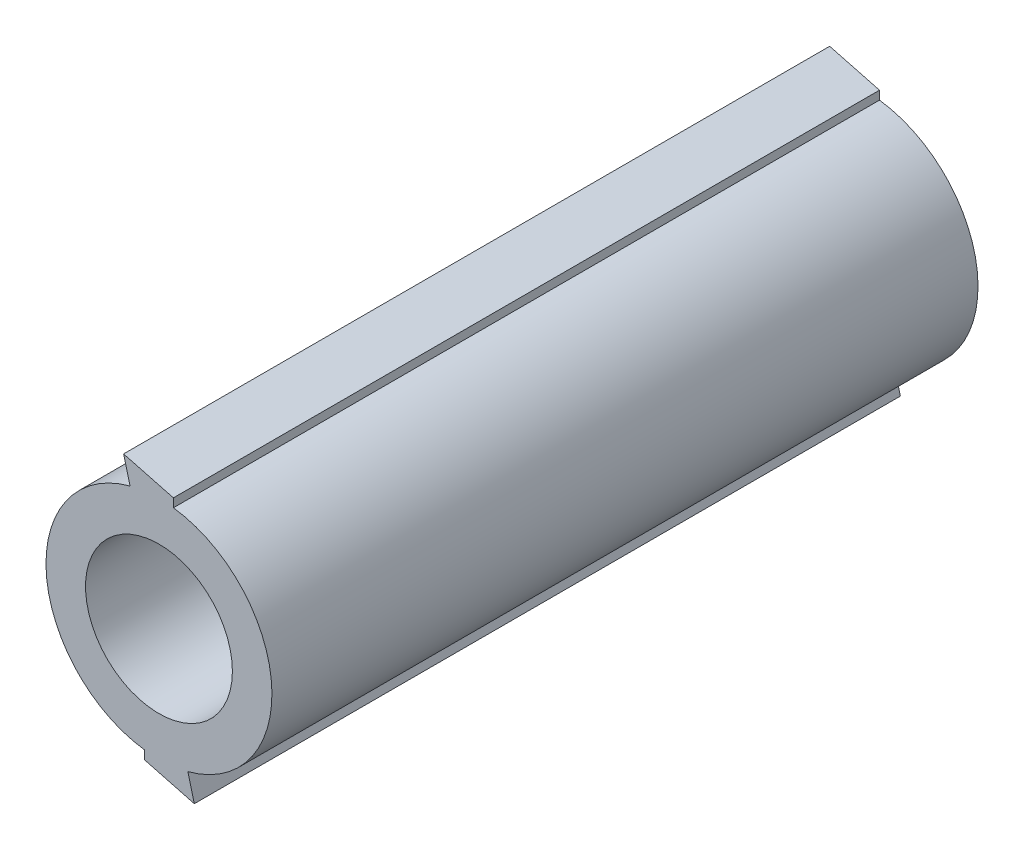
ISO-10303-21;
HEADER;
FILE_DESCRIPTION(('STEP AP214'),'2;1');
FILE_NAME('part.step','',(''),(''),'','','');
FILE_SCHEMA(('AUTOMOTIVE_DESIGN { 1 0 10303 214 1 1 1 1 }'));
ENDSEC;
DATA;
#1=APPLICATION_CONTEXT('core data for automotive mechanical design processes');
#2=APPLICATION_PROTOCOL_DEFINITION('international standard','automotive_design',2000,#1);
#3=PRODUCT_CONTEXT('',#1,'mechanical');
#4=PRODUCT('Part','Part','',(#3));
#5=PRODUCT_RELATED_PRODUCT_CATEGORY('part','',(#4));
#6=PRODUCT_DEFINITION_FORMATION('','',#4);
#7=PRODUCT_DEFINITION_CONTEXT('part definition',#1,'design');
#8=PRODUCT_DEFINITION('design','',#6,#7);
#9=PRODUCT_DEFINITION_SHAPE('','',#8);
#10=(LENGTH_UNIT() NAMED_UNIT(*) SI_UNIT(.MILLI.,.METRE.));
#11=(NAMED_UNIT(*) PLANE_ANGLE_UNIT() SI_UNIT($,.RADIAN.));
#12=(NAMED_UNIT(*) SI_UNIT($,.STERADIAN.) SOLID_ANGLE_UNIT());
#13=UNCERTAINTY_MEASURE_WITH_UNIT(LENGTH_MEASURE(1.E-05),#10,'distance_accuracy_value','');
#14=(GEOMETRIC_REPRESENTATION_CONTEXT(3) GLOBAL_UNCERTAINTY_ASSIGNED_CONTEXT((#13)) GLOBAL_UNIT_ASSIGNED_CONTEXT((#10,
#11,#12)) REPRESENTATION_CONTEXT('',''));
#15=CARTESIAN_POINT('',(0.,0.,0.));
#16=DIRECTION('',(0.,0.,1.));
#17=DIRECTION('',(1.,0.,0.));
#18=AXIS2_PLACEMENT_3D('',#15,#16,#17);
#19=CARTESIAN_POINT('',(0.,0.,200.));
#20=DIRECTION('',(0.,0.,-1.));
#21=DIRECTION('',(-1.,0.,0.));
#22=AXIS2_PLACEMENT_3D('',#19,#20,#21);
#23=CYLINDRICAL_SURFACE('',#22,32.);
#24=DIRECTION('',(0.,0.,1.));
#25=VECTOR('',#24,1.);
#26=CARTESIAN_POINT('',(-4.09392435380043,-31.7370411882608,0.));
#27=LINE('',#26,#25);
#28=CARTESIAN_POINT('',(-4.09392435380043,-31.7370411882608,0.));
#29=VERTEX_POINT('',#28);
#30=CARTESIAN_POINT('',(-4.09392435380043,-31.7370411882608,200.));
#31=VERTEX_POINT('',#30);
#32=EDGE_CURVE('E147',#29,#31,#27,.T.);
#33=ORIENTED_EDGE('',*,*,#32,.T.);
#34=CARTESIAN_POINT('',(0.,0.,200.));
#35=DIRECTION('',(0.,0.,1.));
#36=DIRECTION('',(1.,0.,0.));
#37=AXIS2_PLACEMENT_3D('',#34,#35,#36);
#38=CIRCLE('',#37,32.);
#39=CARTESIAN_POINT('',(-8.1791238977649,30.9370640537368,200.));
#40=VERTEX_POINT('',#39);
#41=EDGE_CURVE('E11',#40,#31,#38,.T.);
#42=ORIENTED_EDGE('',*,*,#41,.F.);
#43=DIRECTION('',(0.,0.,1.));
#44=VECTOR('',#43,1.);
#45=CARTESIAN_POINT('',(-8.1791238977649,30.9370640537368,0.));
#46=LINE('',#45,#44);
#47=CARTESIAN_POINT('',(-8.1791238977649,30.9370640537368,0.));
#48=VERTEX_POINT('',#47);
#49=EDGE_CURVE('E133',#48,#40,#46,.T.);
#50=ORIENTED_EDGE('',*,*,#49,.F.);
#51=CARTESIAN_POINT('',(0.,0.,0.));
#52=DIRECTION('',(0.,0.,1.));
#53=DIRECTION('',(1.,0.,0.));
#54=AXIS2_PLACEMENT_3D('',#51,#52,#53);
#55=CIRCLE('',#54,32.);
#56=EDGE_CURVE('E157',#48,#29,#55,.T.);
#57=ORIENTED_EDGE('',*,*,#56,.T.);
#58=EDGE_LOOP('',(#33,#42,#50,#57));
#59=FACE_BOUND('',#58,.T.);
#60=ADVANCED_FACE('F41',(#59),#23,.T.);
#61=DIRECTION('',(0.,0.,1.));
#62=VECTOR('',#61,1.);
#63=CARTESIAN_POINT('',(8.17912389776288,-30.9370640537373,0.));
#64=LINE('',#63,#62);
#65=CARTESIAN_POINT('',(8.17912389776288,-30.9370640537373,0.));
#66=VERTEX_POINT('',#65);
#67=CARTESIAN_POINT('',(8.17912389776288,-30.9370640537373,200.));
#68=VERTEX_POINT('',#67);
#69=EDGE_CURVE('E153',#66,#68,#64,.T.);
#70=ORIENTED_EDGE('',*,*,#69,.F.);
#71=CARTESIAN_POINT('',(0.,0.,0.));
#72=DIRECTION('',(0.,0.,1.));
#73=DIRECTION('',(1.,0.,0.));
#74=AXIS2_PLACEMENT_3D('',#71,#72,#73);
#75=CIRCLE('',#74,32.);
#76=CARTESIAN_POINT('',(4.09392435379836,31.737041188261,0.));
#77=VERTEX_POINT('',#76);
#78=EDGE_CURVE('E127',#66,#77,#75,.T.);
#79=ORIENTED_EDGE('',*,*,#78,.T.);
#80=DIRECTION('',(0.,0.,1.));
#81=VECTOR('',#80,1.);
#82=CARTESIAN_POINT('',(4.09392435379836,31.737041188261,0.));
#83=LINE('',#82,#81);
#84=CARTESIAN_POINT('',(4.09392435379836,31.737041188261,200.));
#85=VERTEX_POINT('',#84);
#86=EDGE_CURVE('E125',#77,#85,#83,.T.);
#87=ORIENTED_EDGE('',*,*,#86,.T.);
#88=CARTESIAN_POINT('',(0.,0.,200.));
#89=DIRECTION('',(0.,0.,1.));
#90=DIRECTION('',(1.,0.,0.));
#91=AXIS2_PLACEMENT_3D('',#88,#89,#90);
#92=CIRCLE('',#91,32.);
#93=EDGE_CURVE('E52',#68,#85,#92,.T.);
#94=ORIENTED_EDGE('',*,*,#93,.F.);
#95=EDGE_LOOP('',(#70,#79,#87,#94));
#96=FACE_BOUND('',#95,.T.);
#97=ADVANCED_FACE('F126',(#96),#23,.T.);
#98=CARTESIAN_POINT('',(0.,0.,200.));
#99=DIRECTION('',(0.,0.,-1.));
#100=DIRECTION('',(-1.,0.,0.));
#101=AXIS2_PLACEMENT_3D('',#98,#99,#100);
#102=CYLINDRICAL_SURFACE('',#101,20.8);
#103=CARTESIAN_POINT('',(0.,0.,200.));
#104=DIRECTION('',(0.,0.,1.));
#105=DIRECTION('',(1.,0.,0.));
#106=AXIS2_PLACEMENT_3D('',#103,#104,#105);
#107=CIRCLE('',#106,20.8);
#108=CARTESIAN_POINT('',(20.8,0.,200.));
#109=VERTEX_POINT('',#108);
#110=EDGE_CURVE('E122',#109,#109,#107,.T.);
#111=ORIENTED_EDGE('',*,*,#110,.T.);
#112=EDGE_LOOP('',(#111));
#113=FACE_BOUND('',#112,.T.);
#114=CARTESIAN_POINT('',(0.,0.,0.));
#115=DIRECTION('',(0.,0.,1.));
#116=DIRECTION('',(1.,0.,0.));
#117=AXIS2_PLACEMENT_3D('',#114,#115,#116);
#118=CIRCLE('',#117,20.8);
#119=CARTESIAN_POINT('',(20.8,0.,0.));
#120=VERTEX_POINT('',#119);
#121=EDGE_CURVE('E158',#120,#120,#118,.T.);
#122=ORIENTED_EDGE('',*,*,#121,.F.);
#123=EDGE_LOOP('',(#122));
#124=FACE_BOUND('',#123,.T.);
#125=ADVANCED_FACE('F277',(#113,#124),#102,.F.);
#126=CARTESIAN_POINT('',(0.,0.,200.));
#127=DIRECTION('',(0.,0.,1.));
#128=DIRECTION('',(1.,0.,0.));
#129=AXIS2_PLACEMENT_3D('',#126,#127,#128);
#130=PLANE('',#129);
#131=ORIENTED_EDGE('',*,*,#110,.F.);
#132=EDGE_LOOP('',(#131));
#133=FACE_BOUND('',#132,.T.);
#134=ORIENTED_EDGE('',*,*,#41,.T.);
#135=DIRECTION('',(0.,1.,0.));
#136=VECTOR('',#135,1.);
#137=CARTESIAN_POINT('',(-4.09392435379839,2.72570661015883E-13,200.));
#138=LINE('',#137,#136);
#139=CARTESIAN_POINT('',(-4.09392435380058,-34.1818057680252,200.));
#140=VERTEX_POINT('',#139);
#141=EDGE_CURVE('E101',#140,#31,#138,.T.);
#142=ORIENTED_EDGE('',*,*,#141,.F.);
#143=DIRECTION('',(-0.967039824193414,0.254625172408328,0.));
#144=VECTOR('',#143,1.);
#145=CARTESIAN_POINT('',(-8.68210311175342,-32.9737212837504,200.));
#146=LINE('',#145,#144);
#147=CARTESIAN_POINT('',(10.0194267747595,-37.8979034658282,200.));
#148=VERTEX_POINT('',#147);
#149=EDGE_CURVE('E249',#148,#140,#146,.T.);
#150=ORIENTED_EDGE('',*,*,#149,.F.);
#151=DIRECTION('',(0.255597621805091,-0.96678325167929,0.));
#152=VECTOR('',#151,1.);
#153=CARTESIAN_POINT('',(0.,0.,200.));
#154=LINE('',#153,#152);
#155=EDGE_CURVE('E120',#68,#148,#154,.T.);
#156=ORIENTED_EDGE('',*,*,#155,.F.);
#157=ORIENTED_EDGE('',*,*,#93,.T.);
#158=DIRECTION('',(0.,-1.,0.));
#159=VECTOR('',#158,1.);
#160=CARTESIAN_POINT('',(4.09392435379836,0.,200.));
#161=LINE('',#160,#159);
#162=CARTESIAN_POINT('',(4.09392435379836,34.1818057680255,200.));
#163=VERTEX_POINT('',#162);
#164=EDGE_CURVE('E119',#163,#85,#161,.T.);
#165=ORIENTED_EDGE('',*,*,#164,.F.);
#166=DIRECTION('',(0.96703982419343,-0.254625172408267,0.));
#167=VECTOR('',#166,1.);
#168=CARTESIAN_POINT('',(8.68210311175129,32.9737212837509,200.));
#169=LINE('',#168,#167);
#170=CARTESIAN_POINT('',(-10.019426774762,37.8979034658276,200.));
#171=VERTEX_POINT('',#170);
#172=EDGE_CURVE('E140',#171,#163,#169,.T.);
#173=ORIENTED_EDGE('',*,*,#172,.F.);
#174=DIRECTION('',(-0.255597621805152,0.966783251679274,0.));
#175=VECTOR('',#174,1.);
#176=CARTESIAN_POINT('',(0.,0.,200.));
#177=LINE('',#176,#175);
#178=EDGE_CURVE('E145',#40,#171,#177,.T.);
#179=ORIENTED_EDGE('',*,*,#178,.F.);
#180=EDGE_LOOP('',(#134,#142,#150,#156,#157,#165,#173,#179));
#181=FACE_BOUND('',#180,.T.);
#182=ADVANCED_FACE('F116',(#133,#181),#130,.T.);
#183=CARTESIAN_POINT('',(0.,0.,0.));
#184=DIRECTION('',(0.,0.,1.));
#185=DIRECTION('',(1.,0.,0.));
#186=AXIS2_PLACEMENT_3D('',#183,#184,#185);
#187=PLANE('',#186);
#188=CARTESIAN_POINT('',(0.,26.4,0.));
#189=DIRECTION('',(0.,0.,-1.));
#190=DIRECTION('',(-1.,0.,0.));
#191=AXIS2_PLACEMENT_3D('',#188,#189,#190);
#192=CIRCLE('',#191,3.2);
#193=CARTESIAN_POINT('',(-3.20000000000002,26.4,0.));
#194=VERTEX_POINT('',#193);
#195=EDGE_CURVE('E160',#194,#194,#192,.T.);
#196=ORIENTED_EDGE('',*,*,#195,.F.);
#197=EDGE_LOOP('',(#196));
#198=FACE_BOUND('',#197,.T.);
#199=CARTESIAN_POINT('',(-22.8630706599098,13.200000000001,0.));
#200=DIRECTION('',(0.,0.,-1.));
#201=DIRECTION('',(-1.,0.,0.));
#202=AXIS2_PLACEMENT_3D('',#199,#200,#201);
#203=CIRCLE('',#202,3.20000000000032);
#204=CARTESIAN_POINT('',(-26.0630706599101,13.200000000001,0.));
#205=VERTEX_POINT('',#204);
#206=EDGE_CURVE('E166',#205,#205,#203,.T.);
#207=ORIENTED_EDGE('',*,*,#206,.F.);
#208=EDGE_LOOP('',(#207));
#209=FACE_BOUND('',#208,.T.);
#210=CARTESIAN_POINT('',(-22.8630706599109,-13.199999999999,0.));
#211=DIRECTION('',(0.,0.,-1.));
#212=DIRECTION('',(-1.,0.,0.));
#213=AXIS2_PLACEMENT_3D('',#210,#211,#212);
#214=CIRCLE('',#213,3.20000000000145);
#215=CARTESIAN_POINT('',(-26.0630706599123,-13.199999999999,0.));
#216=VERTEX_POINT('',#215);
#217=EDGE_CURVE('E171',#216,#216,#214,.T.);
#218=ORIENTED_EDGE('',*,*,#217,.F.);
#219=EDGE_LOOP('',(#218));
#220=FACE_BOUND('',#219,.T.);
#221=CARTESIAN_POINT('',(-2.26164573180476E-12,-26.4,0.));
#222=DIRECTION('',(0.,0.,-1.));
#223=DIRECTION('',(-1.,0.,0.));
#224=AXIS2_PLACEMENT_3D('',#221,#222,#223);
#225=CIRCLE('',#224,3.20000000000232);
#226=CARTESIAN_POINT('',(-3.20000000000458,-26.4,0.));
#227=VERTEX_POINT('',#226);
#228=EDGE_CURVE('E176',#227,#227,#225,.T.);
#229=ORIENTED_EDGE('',*,*,#228,.F.);
#230=EDGE_LOOP('',(#229));
#231=FACE_BOUND('',#230,.T.);
#232=CARTESIAN_POINT('',(22.8630706599075,-13.200000000001,0.));
#233=DIRECTION('',(0.,0.,-1.));
#234=DIRECTION('',(-1.,0.,0.));
#235=AXIS2_PLACEMENT_3D('',#232,#233,#234);
#236=CIRCLE('',#235,3.20000000000214);
#237=CARTESIAN_POINT('',(19.6630706599053,-13.200000000001,0.));
#238=VERTEX_POINT('',#237);
#239=EDGE_CURVE('E181',#238,#238,#236,.T.);
#240=ORIENTED_EDGE('',*,*,#239,.F.);
#241=EDGE_LOOP('',(#240));
#242=FACE_BOUND('',#241,.T.);
#243=CARTESIAN_POINT('',(22.8630706599086,13.199999999999,0.));
#244=DIRECTION('',(0.,0.,-1.));
#245=DIRECTION('',(-1.,0.,0.));
#246=AXIS2_PLACEMENT_3D('',#243,#244,#245);
#247=CIRCLE('',#246,3.20000000000114);
#248=CARTESIAN_POINT('',(19.6630706599075,13.199999999999,0.));
#249=VERTEX_POINT('',#248);
#250=EDGE_CURVE('E165',#249,#249,#247,.T.);
#251=ORIENTED_EDGE('',*,*,#250,.F.);
#252=EDGE_LOOP('',(#251));
#253=FACE_BOUND('',#252,.T.);
#254=ORIENTED_EDGE('',*,*,#121,.T.);
#255=EDGE_LOOP('',(#254));
#256=FACE_BOUND('',#255,.T.);
#257=ORIENTED_EDGE('',*,*,#56,.F.);
#258=DIRECTION('',(-0.255597621805152,0.966783251679274,0.));
#259=VECTOR('',#258,1.);
#260=CARTESIAN_POINT('',(0.,0.,0.));
#261=LINE('',#260,#259);
#262=CARTESIAN_POINT('',(-10.019426774762,37.8979034658276,0.));
#263=VERTEX_POINT('',#262);
#264=EDGE_CURVE('E192',#48,#263,#261,.T.);
#265=ORIENTED_EDGE('',*,*,#264,.T.);
#266=DIRECTION('',(0.96703982419343,-0.254625172408267,0.));
#267=VECTOR('',#266,1.);
#268=CARTESIAN_POINT('',(8.68210311175129,32.9737212837509,0.));
#269=LINE('',#268,#267);
#270=CARTESIAN_POINT('',(4.09392435379836,34.1818057680255,0.));
#271=VERTEX_POINT('',#270);
#272=EDGE_CURVE('E195',#263,#271,#269,.T.);
#273=ORIENTED_EDGE('',*,*,#272,.T.);
#274=DIRECTION('',(0.,-1.,0.));
#275=VECTOR('',#274,1.);
#276=CARTESIAN_POINT('',(4.09392435379836,0.,0.));
#277=LINE('',#276,#275);
#278=EDGE_CURVE('E152',#271,#77,#277,.T.);
#279=ORIENTED_EDGE('',*,*,#278,.T.);
#280=ORIENTED_EDGE('',*,*,#78,.F.);
#281=DIRECTION('',(0.255597621805091,-0.96678325167929,0.));
#282=VECTOR('',#281,1.);
#283=CARTESIAN_POINT('',(0.,0.,0.));
#284=LINE('',#283,#282);
#285=CARTESIAN_POINT('',(10.0194267747595,-37.8979034658282,0.));
#286=VERTEX_POINT('',#285);
#287=EDGE_CURVE('E93',#66,#286,#284,.T.);
#288=ORIENTED_EDGE('',*,*,#287,.T.);
#289=DIRECTION('',(-0.967039824193414,0.254625172408328,0.));
#290=VECTOR('',#289,1.);
#291=CARTESIAN_POINT('',(-8.68210311175342,-32.9737212837504,0.));
#292=LINE('',#291,#290);
#293=CARTESIAN_POINT('',(-4.09392435380058,-34.1818057680252,0.));
#294=VERTEX_POINT('',#293);
#295=EDGE_CURVE('E203',#286,#294,#292,.T.);
#296=ORIENTED_EDGE('',*,*,#295,.T.);
#297=DIRECTION('',(0.,1.,0.));
#298=VECTOR('',#297,1.);
#299=CARTESIAN_POINT('',(-4.09392435379839,2.72570661015883E-13,0.));
#300=LINE('',#299,#298);
#301=EDGE_CURVE('E202',#294,#29,#300,.T.);
#302=ORIENTED_EDGE('',*,*,#301,.T.);
#303=EDGE_LOOP('',(#257,#265,#273,#279,#280,#288,#296,#302));
#304=FACE_BOUND('',#303,.T.);
#305=ADVANCED_FACE('F265',(#198,#209,#220,#231,#242,#253,#256,#304),#187,.F.);
#306=CARTESIAN_POINT('',(22.8630706599086,13.199999999999,10.));
#307=DIRECTION('',(0.,0.,-1.));
#308=DIRECTION('',(-1.,0.,0.));
#309=AXIS2_PLACEMENT_3D('',#306,#307,#308);
#310=CYLINDRICAL_SURFACE('',#309,3.20000000000114);
#311=CARTESIAN_POINT('',(22.8630706599086,13.199999999999,10.));
#312=DIRECTION('',(0.,0.,-1.));
#313=DIRECTION('',(-1.,0.,0.));
#314=AXIS2_PLACEMENT_3D('',#311,#312,#313);
#315=CIRCLE('',#314,3.20000000000114);
#316=CARTESIAN_POINT('',(19.6630706599075,13.199999999999,10.));
#317=VERTEX_POINT('',#316);
#318=EDGE_CURVE('E185',#317,#317,#315,.T.);
#319=ORIENTED_EDGE('',*,*,#318,.F.);
#320=EDGE_LOOP('',(#319));
#321=FACE_BOUND('',#320,.T.);
#322=ORIENTED_EDGE('',*,*,#250,.T.);
#323=EDGE_LOOP('',(#322));
#324=FACE_BOUND('',#323,.T.);
#325=ADVANCED_FACE('F267',(#321,#324),#310,.F.);
#326=CARTESIAN_POINT('',(22.8630706599086,13.199999999999,10.));
#327=DIRECTION('',(0.,0.,-1.));
#328=DIRECTION('',(-1.,0.,0.));
#329=AXIS2_PLACEMENT_3D('',#326,#327,#328);
#330=PLANE('',#329);
#331=ORIENTED_EDGE('',*,*,#318,.T.);
#332=EDGE_LOOP('',(#331));
#333=FACE_BOUND('',#332,.T.);
#334=ADVANCED_FACE('F274',(#333),#330,.T.);
#335=CARTESIAN_POINT('',(22.8630706599075,-13.200000000001,10.));
#336=DIRECTION('',(0.,0.,-1.));
#337=DIRECTION('',(-1.,0.,0.));
#338=AXIS2_PLACEMENT_3D('',#335,#336,#337);
#339=CYLINDRICAL_SURFACE('',#338,3.20000000000214);
#340=CARTESIAN_POINT('',(22.8630706599075,-13.200000000001,10.));
#341=DIRECTION('',(0.,0.,-1.));
#342=DIRECTION('',(-1.,0.,0.));
#343=AXIS2_PLACEMENT_3D('',#340,#341,#342);
#344=CIRCLE('',#343,3.20000000000214);
#345=CARTESIAN_POINT('',(19.6630706599053,-13.200000000001,10.));
#346=VERTEX_POINT('',#345);
#347=EDGE_CURVE('E180',#346,#346,#344,.T.);
#348=ORIENTED_EDGE('',*,*,#347,.F.);
#349=EDGE_LOOP('',(#348));
#350=FACE_BOUND('',#349,.T.);
#351=ORIENTED_EDGE('',*,*,#239,.T.);
#352=EDGE_LOOP('',(#351));
#353=FACE_BOUND('',#352,.T.);
#354=ADVANCED_FACE('F325',(#350,#353),#339,.F.);
#355=CARTESIAN_POINT('',(22.8630706599075,-13.200000000001,10.));
#356=DIRECTION('',(0.,0.,-1.));
#357=DIRECTION('',(-1.,0.,0.));
#358=AXIS2_PLACEMENT_3D('',#355,#356,#357);
#359=PLANE('',#358);
#360=ORIENTED_EDGE('',*,*,#347,.T.);
#361=EDGE_LOOP('',(#360));
#362=FACE_BOUND('',#361,.T.);
#363=ADVANCED_FACE('F335',(#362),#359,.T.);
#364=CARTESIAN_POINT('',(-2.26164573180476E-12,-26.4,10.));
#365=DIRECTION('',(0.,0.,-1.));
#366=DIRECTION('',(-1.,0.,0.));
#367=AXIS2_PLACEMENT_3D('',#364,#365,#366);
#368=CYLINDRICAL_SURFACE('',#367,3.20000000000232);
#369=CARTESIAN_POINT('',(-2.26164573180476E-12,-26.4,10.));
#370=DIRECTION('',(0.,0.,-1.));
#371=DIRECTION('',(-1.,0.,0.));
#372=AXIS2_PLACEMENT_3D('',#369,#370,#371);
#373=CIRCLE('',#372,3.20000000000232);
#374=CARTESIAN_POINT('',(-3.20000000000458,-26.4,10.));
#375=VERTEX_POINT('',#374);
#376=EDGE_CURVE('E175',#375,#375,#373,.T.);
#377=ORIENTED_EDGE('',*,*,#376,.F.);
#378=EDGE_LOOP('',(#377));
#379=FACE_BOUND('',#378,.T.);
#380=ORIENTED_EDGE('',*,*,#228,.T.);
#381=EDGE_LOOP('',(#380));
#382=FACE_BOUND('',#381,.T.);
#383=ADVANCED_FACE('F345',(#379,#382),#368,.F.);
#384=CARTESIAN_POINT('',(-2.26118427355213E-12,-26.4,10.));
#385=DIRECTION('',(0.,0.,-1.));
#386=DIRECTION('',(-1.,0.,0.));
#387=AXIS2_PLACEMENT_3D('',#384,#385,#386);
#388=PLANE('',#387);
#389=ORIENTED_EDGE('',*,*,#376,.T.);
#390=EDGE_LOOP('',(#389));
#391=FACE_BOUND('',#390,.T.);
#392=ADVANCED_FACE('F355',(#391),#388,.T.);
#393=CARTESIAN_POINT('',(-22.8630706599109,-13.199999999999,10.));
#394=DIRECTION('',(0.,0.,-1.));
#395=DIRECTION('',(-1.,0.,0.));
#396=AXIS2_PLACEMENT_3D('',#393,#394,#395);
#397=CYLINDRICAL_SURFACE('',#396,3.20000000000145);
#398=CARTESIAN_POINT('',(-22.8630706599109,-13.199999999999,10.));
#399=DIRECTION('',(0.,0.,-1.));
#400=DIRECTION('',(-1.,0.,0.));
#401=AXIS2_PLACEMENT_3D('',#398,#399,#400);
#402=CIRCLE('',#401,3.20000000000145);
#403=CARTESIAN_POINT('',(-26.0630706599123,-13.199999999999,10.));
#404=VERTEX_POINT('',#403);
#405=EDGE_CURVE('E170',#404,#404,#402,.T.);
#406=ORIENTED_EDGE('',*,*,#405,.F.);
#407=EDGE_LOOP('',(#406));
#408=FACE_BOUND('',#407,.T.);
#409=ORIENTED_EDGE('',*,*,#217,.T.);
#410=EDGE_LOOP('',(#409));
#411=FACE_BOUND('',#410,.T.);
#412=ADVANCED_FACE('F365',(#408,#411),#397,.F.);
#413=CARTESIAN_POINT('',(-22.8630706599109,-13.199999999999,10.));
#414=DIRECTION('',(0.,0.,-1.));
#415=DIRECTION('',(-1.,0.,0.));
#416=AXIS2_PLACEMENT_3D('',#413,#414,#415);
#417=PLANE('',#416);
#418=ORIENTED_EDGE('',*,*,#405,.T.);
#419=EDGE_LOOP('',(#418));
#420=FACE_BOUND('',#419,.T.);
#421=ADVANCED_FACE('F375',(#420),#417,.T.);
#422=CARTESIAN_POINT('',(-22.8630706599098,13.200000000001,10.));
#423=DIRECTION('',(0.,0.,-1.));
#424=DIRECTION('',(-1.,0.,0.));
#425=AXIS2_PLACEMENT_3D('',#422,#423,#424);
#426=CYLINDRICAL_SURFACE('',#425,3.20000000000032);
#427=CARTESIAN_POINT('',(-22.8630706599098,13.200000000001,10.));
#428=DIRECTION('',(0.,0.,-1.));
#429=DIRECTION('',(-1.,0.,0.));
#430=AXIS2_PLACEMENT_3D('',#427,#428,#429);
#431=CIRCLE('',#430,3.20000000000032);
#432=CARTESIAN_POINT('',(-26.0630706599101,13.200000000001,10.));
#433=VERTEX_POINT('',#432);
#434=EDGE_CURVE('E132',#433,#433,#431,.T.);
#435=ORIENTED_EDGE('',*,*,#434,.F.);
#436=EDGE_LOOP('',(#435));
#437=FACE_BOUND('',#436,.T.);
#438=ORIENTED_EDGE('',*,*,#206,.T.);
#439=EDGE_LOOP('',(#438));
#440=FACE_BOUND('',#439,.T.);
#441=ADVANCED_FACE('F385',(#437,#440),#426,.F.);
#442=CARTESIAN_POINT('',(-22.8630706599098,13.200000000001,10.));
#443=DIRECTION('',(0.,0.,-1.));
#444=DIRECTION('',(-1.,0.,0.));
#445=AXIS2_PLACEMENT_3D('',#442,#443,#444);
#446=PLANE('',#445);
#447=ORIENTED_EDGE('',*,*,#434,.T.);
#448=EDGE_LOOP('',(#447));
#449=FACE_BOUND('',#448,.T.);
#450=ADVANCED_FACE('F395',(#449),#446,.T.);
#451=CARTESIAN_POINT('',(0.,26.4,10.));
#452=DIRECTION('',(0.,0.,-1.));
#453=DIRECTION('',(-1.,0.,0.));
#454=AXIS2_PLACEMENT_3D('',#451,#452,#453);
#455=CYLINDRICAL_SURFACE('',#454,3.2);
#456=CARTESIAN_POINT('',(0.,26.4,10.));
#457=DIRECTION('',(0.,0.,-1.));
#458=DIRECTION('',(-1.,0.,0.));
#459=AXIS2_PLACEMENT_3D('',#456,#457,#458);
#460=CIRCLE('',#459,3.2);
#461=CARTESIAN_POINT('',(-3.20000000000002,26.4,10.));
#462=VERTEX_POINT('',#461);
#463=EDGE_CURVE('E164',#462,#462,#460,.T.);
#464=ORIENTED_EDGE('',*,*,#463,.F.);
#465=EDGE_LOOP('',(#464));
#466=FACE_BOUND('',#465,.T.);
#467=ORIENTED_EDGE('',*,*,#195,.T.);
#468=EDGE_LOOP('',(#467));
#469=FACE_BOUND('',#468,.T.);
#470=ADVANCED_FACE('F405',(#466,#469),#455,.F.);
#471=CARTESIAN_POINT('',(0.,26.4,10.));
#472=DIRECTION('',(0.,0.,-1.));
#473=DIRECTION('',(-1.,0.,0.));
#474=AXIS2_PLACEMENT_3D('',#471,#472,#473);
#475=PLANE('',#474);
#476=ORIENTED_EDGE('',*,*,#463,.T.);
#477=EDGE_LOOP('',(#476));
#478=FACE_BOUND('',#477,.T.);
#479=ADVANCED_FACE('F415',(#478),#475,.T.);
#480=CARTESIAN_POINT('',(4.09392435379836,0.,0.));
#481=DIRECTION('',(-1.,0.,0.));
#482=DIRECTION('',(0.,0.,1.));
#483=AXIS2_PLACEMENT_3D('',#480,#481,#482);
#484=PLANE('',#483);
#485=ORIENTED_EDGE('',*,*,#164,.T.);
#486=ORIENTED_EDGE('',*,*,#86,.F.);
#487=ORIENTED_EDGE('',*,*,#278,.F.);
#488=DIRECTION('',(0.,0.,1.));
#489=VECTOR('',#488,1.);
#490=CARTESIAN_POINT('',(4.09392435379836,34.1818057680255,0.));
#491=LINE('',#490,#489);
#492=EDGE_CURVE('E138',#271,#163,#491,.T.);
#493=ORIENTED_EDGE('',*,*,#492,.T.);
#494=EDGE_LOOP('',(#485,#486,#487,#493));
#495=FACE_BOUND('',#494,.T.);
#496=ADVANCED_FACE('F136',(#495),#484,.F.);
#497=CARTESIAN_POINT('',(0.,0.,0.));
#498=DIRECTION('',(0.966783251679274,0.255597621805152,0.));
#499=DIRECTION('',(-0.255597621805152,0.966783251679274,0.));
#500=AXIS2_PLACEMENT_3D('',#497,#498,#499);
#501=PLANE('',#500);
#502=ORIENTED_EDGE('',*,*,#178,.T.);
#503=DIRECTION('',(0.,0.,1.));
#504=VECTOR('',#503,1.);
#505=CARTESIAN_POINT('',(-10.019426774762,37.8979034658276,0.));
#506=LINE('',#505,#504);
#507=EDGE_CURVE('E229',#263,#171,#506,.T.);
#508=ORIENTED_EDGE('',*,*,#507,.F.);
#509=ORIENTED_EDGE('',*,*,#264,.F.);
#510=ORIENTED_EDGE('',*,*,#49,.T.);
#511=EDGE_LOOP('',(#502,#508,#509,#510));
#512=FACE_BOUND('',#511,.T.);
#513=ADVANCED_FACE('F434',(#512),#501,.F.);
#514=CARTESIAN_POINT('',(8.68210311175129,32.9737212837509,0.));
#515=DIRECTION('',(-0.254625172408267,-0.96703982419343,0.));
#516=DIRECTION('',(0.96703982419343,-0.254625172408267,0.));
#517=AXIS2_PLACEMENT_3D('',#514,#515,#516);
#518=PLANE('',#517);
#519=ORIENTED_EDGE('',*,*,#172,.T.);
#520=ORIENTED_EDGE('',*,*,#492,.F.);
#521=ORIENTED_EDGE('',*,*,#272,.F.);
#522=ORIENTED_EDGE('',*,*,#507,.T.);
#523=EDGE_LOOP('',(#519,#520,#521,#522));
#524=FACE_BOUND('',#523,.T.);
#525=ADVANCED_FACE('F443',(#524),#518,.F.);
#526=CARTESIAN_POINT('',(-8.68210311175342,-32.9737212837504,0.));
#527=DIRECTION('',(0.254625172408328,0.967039824193414,0.));
#528=DIRECTION('',(-0.967039824193414,0.254625172408328,0.));
#529=AXIS2_PLACEMENT_3D('',#526,#527,#528);
#530=PLANE('',#529);
#531=ORIENTED_EDGE('',*,*,#149,.T.);
#532=DIRECTION('',(0.,0.,1.));
#533=VECTOR('',#532,1.);
#534=CARTESIAN_POINT('',(-4.09392435380058,-34.1818057680252,0.));
#535=LINE('',#534,#533);
#536=EDGE_CURVE('E141',#294,#140,#535,.T.);
#537=ORIENTED_EDGE('',*,*,#536,.F.);
#538=ORIENTED_EDGE('',*,*,#295,.F.);
#539=DIRECTION('',(0.,0.,1.));
#540=VECTOR('',#539,1.);
#541=CARTESIAN_POINT('',(10.0194267747595,-37.8979034658282,0.));
#542=LINE('',#541,#540);
#543=EDGE_CURVE('E45',#286,#148,#542,.T.);
#544=ORIENTED_EDGE('',*,*,#543,.T.);
#545=EDGE_LOOP('',(#531,#537,#538,#544));
#546=FACE_BOUND('',#545,.T.);
#547=ADVANCED_FACE('F257',(#546),#530,.F.);
#548=CARTESIAN_POINT('',(-4.09392435379839,2.72570661015883E-13,0.));
#549=DIRECTION('',(1.,0.,0.));
#550=DIRECTION('',(0.,1.,0.));
#551=AXIS2_PLACEMENT_3D('',#548,#549,#550);
#552=PLANE('',#551);
#553=ORIENTED_EDGE('',*,*,#141,.T.);
#554=ORIENTED_EDGE('',*,*,#32,.F.);
#555=ORIENTED_EDGE('',*,*,#301,.F.);
#556=ORIENTED_EDGE('',*,*,#536,.T.);
#557=EDGE_LOOP('',(#553,#554,#555,#556));
#558=FACE_BOUND('',#557,.T.);
#559=ADVANCED_FACE('F264',(#558),#552,.F.);
#560=CARTESIAN_POINT('',(0.,0.,0.));
#561=DIRECTION('',(-0.96678325167929,-0.25559762180509,0.));
#562=DIRECTION('',(0.25559762180509,-0.96678325167929,0.));
#563=AXIS2_PLACEMENT_3D('',#560,#561,#562);
#564=PLANE('',#563);
#565=ORIENTED_EDGE('',*,*,#155,.T.);
#566=ORIENTED_EDGE('',*,*,#543,.F.);
#567=ORIENTED_EDGE('',*,*,#287,.F.);
#568=ORIENTED_EDGE('',*,*,#69,.T.);
#569=EDGE_LOOP('',(#565,#566,#567,#568));
#570=FACE_BOUND('',#569,.T.);
#571=ADVANCED_FACE('F43',(#570),#564,.F.);
#572=CLOSED_SHELL('',(#60,#97,#125,#182,#305,#325,#334,#354,#363,#383,#392,#412,#421,#441,#450,
#470,#479,#496,#513,#525,#547,#559,#571));
#573=MANIFOLD_SOLID_BREP('B2',#572);
#574=ADVANCED_BREP_SHAPE_REPRESENTATION('',(#18,#573),#14);
#575=SHAPE_DEFINITION_REPRESENTATION(#9,#574);
ENDSEC;
END-ISO-10303-21;
